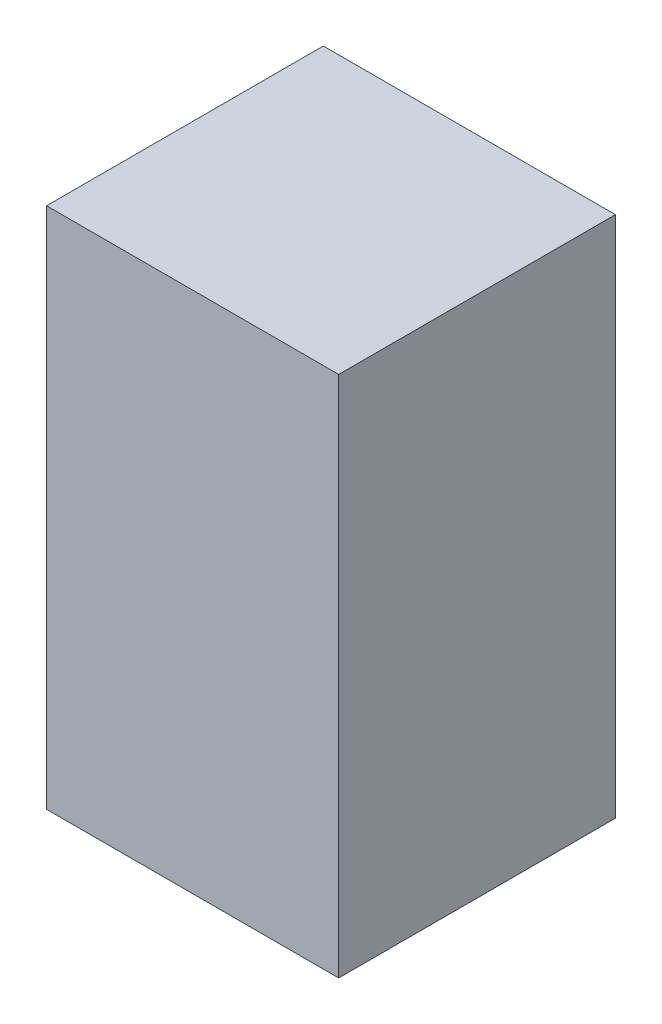
ISO-10303-21;
HEADER;
FILE_DESCRIPTION(('STEP AP214'),'2;1');
FILE_NAME('part.step','',(''),(''),'','','');
FILE_SCHEMA(('AUTOMOTIVE_DESIGN { 1 0 10303 214 1 1 1 1 }'));
ENDSEC;
DATA;
#1=APPLICATION_CONTEXT('core data for automotive mechanical design processes');
#2=APPLICATION_PROTOCOL_DEFINITION('international standard','automotive_design',2000,#1);
#3=PRODUCT_CONTEXT('',#1,'mechanical');
#4=PRODUCT('Part','Part','',(#3));
#5=PRODUCT_RELATED_PRODUCT_CATEGORY('part','',(#4));
#6=PRODUCT_DEFINITION_FORMATION('','',#4);
#7=PRODUCT_DEFINITION_CONTEXT('part definition',#1,'design');
#8=PRODUCT_DEFINITION('design','',#6,#7);
#9=PRODUCT_DEFINITION_SHAPE('','',#8);
#10=(LENGTH_UNIT() NAMED_UNIT(*) SI_UNIT(.MILLI.,.METRE.));
#11=(NAMED_UNIT(*) PLANE_ANGLE_UNIT() SI_UNIT($,.RADIAN.));
#12=(NAMED_UNIT(*) SI_UNIT($,.STERADIAN.) SOLID_ANGLE_UNIT());
#13=UNCERTAINTY_MEASURE_WITH_UNIT(LENGTH_MEASURE(1.E-05),#10,'distance_accuracy_value','');
#14=(GEOMETRIC_REPRESENTATION_CONTEXT(3) GLOBAL_UNCERTAINTY_ASSIGNED_CONTEXT((#13)) GLOBAL_UNIT_ASSIGNED_CONTEXT((#10,
#11,#12)) REPRESENTATION_CONTEXT('',''));
#15=CARTESIAN_POINT('',(0.,0.,0.));
#16=DIRECTION('',(0.,0.,1.));
#17=DIRECTION('',(1.,0.,0.));
#18=AXIS2_PLACEMENT_3D('',#15,#16,#17);
#19=CARTESIAN_POINT('',(0.47500032,-0.85000084,0.90000074));
#20=DIRECTION('',(0.,0.,-1.));
#21=DIRECTION('',(-1.,0.,0.));
#22=AXIS2_PLACEMENT_3D('',#19,#20,#21);
#23=PLANE('',#22);
#24=DIRECTION('',(1.,0.,0.));
#25=VECTOR('',#24,1.);
#26=CARTESIAN_POINT('',(0.47500032,0.85000084,0.90000074));
#27=LINE('',#26,#25);
#28=CARTESIAN_POINT('',(0.47500032,0.85000084,0.90000074));
#29=VERTEX_POINT('',#28);
#30=CARTESIAN_POINT('',(-0.47500032,0.85000084,0.90000074));
#31=VERTEX_POINT('',#30);
#32=EDGE_CURVE('E54',#29,#31,#27,.F.);
#33=ORIENTED_EDGE('',*,*,#32,.T.);
#34=DIRECTION('',(0.,1.,0.));
#35=VECTOR('',#34,1.);
#36=CARTESIAN_POINT('',(-0.47500032,0.85000084,0.90000074));
#37=LINE('',#36,#35);
#38=CARTESIAN_POINT('',(-0.47500032,-0.85000084,0.90000074));
#39=VERTEX_POINT('',#38);
#40=EDGE_CURVE('E56',#31,#39,#37,.F.);
#41=ORIENTED_EDGE('',*,*,#40,.T.);
#42=DIRECTION('',(1.,0.,0.));
#43=VECTOR('',#42,1.);
#44=CARTESIAN_POINT('',(-0.47500032,-0.85000084,0.90000074));
#45=LINE('',#44,#43);
#46=CARTESIAN_POINT('',(0.47500032,-0.85000084,0.90000074));
#47=VERTEX_POINT('',#46);
#48=EDGE_CURVE('E19',#39,#47,#45,.T.);
#49=ORIENTED_EDGE('',*,*,#48,.T.);
#50=DIRECTION('',(0.,1.,0.));
#51=VECTOR('',#50,1.);
#52=CARTESIAN_POINT('',(0.47500032,-0.85000084,0.90000074));
#53=LINE('',#52,#51);
#54=EDGE_CURVE('E79',#47,#29,#53,.T.);
#55=ORIENTED_EDGE('',*,*,#54,.T.);
#56=EDGE_LOOP('',(#33,#41,#49,#55));
#57=FACE_BOUND('',#56,.T.);
#58=ADVANCED_FACE('F16',(#57),#23,.F.);
#59=CARTESIAN_POINT('',(-0.47500032,-0.85000084,0.));
#60=DIRECTION('',(0.,1.,0.));
#61=DIRECTION('',(0.,0.,1.));
#62=AXIS2_PLACEMENT_3D('',#59,#60,#61);
#63=PLANE('',#62);
#64=DIRECTION('',(0.,0.,1.));
#65=VECTOR('',#64,1.);
#66=CARTESIAN_POINT('',(0.47500032,-0.85000084,0.));
#67=LINE('',#66,#65);
#68=CARTESIAN_POINT('',(0.47500032,-0.85000084,0.));
#69=VERTEX_POINT('',#68);
#70=EDGE_CURVE('E67',#69,#47,#67,.T.);
#71=ORIENTED_EDGE('',*,*,#70,.T.);
#72=ORIENTED_EDGE('',*,*,#48,.F.);
#73=DIRECTION('',(0.,0.,-1.));
#74=VECTOR('',#73,1.);
#75=CARTESIAN_POINT('',(-0.47500032,-0.85000084,0.));
#76=LINE('',#75,#74);
#77=CARTESIAN_POINT('',(-0.47500032,-0.85000084,0.));
#78=VERTEX_POINT('',#77);
#79=EDGE_CURVE('E62',#39,#78,#76,.T.);
#80=ORIENTED_EDGE('',*,*,#79,.T.);
#81=DIRECTION('',(-1.,0.,0.));
#82=VECTOR('',#81,1.);
#83=CARTESIAN_POINT('',(0.47500032,-0.85000084,0.));
#84=LINE('',#83,#82);
#85=EDGE_CURVE('E82',#69,#78,#84,.T.);
#86=ORIENTED_EDGE('',*,*,#85,.F.);
#87=EDGE_LOOP('',(#71,#72,#80,#86));
#88=FACE_BOUND('',#87,.T.);
#89=ADVANCED_FACE('F64',(#88),#63,.F.);
#90=CARTESIAN_POINT('',(-0.47500032,0.85000084,0.));
#91=DIRECTION('',(1.,0.,0.));
#92=DIRECTION('',(0.,0.,-1.));
#93=AXIS2_PLACEMENT_3D('',#90,#91,#92);
#94=PLANE('',#93);
#95=ORIENTED_EDGE('',*,*,#79,.F.);
#96=ORIENTED_EDGE('',*,*,#40,.F.);
#97=DIRECTION('',(0.,0.,-1.));
#98=VECTOR('',#97,1.);
#99=CARTESIAN_POINT('',(-0.47500032,0.85000084,0.));
#100=LINE('',#99,#98);
#101=CARTESIAN_POINT('',(-0.47500032,0.85000084,0.));
#102=VERTEX_POINT('',#101);
#103=EDGE_CURVE('E74',#31,#102,#100,.T.);
#104=ORIENTED_EDGE('',*,*,#103,.T.);
#105=DIRECTION('',(0.,1.,0.));
#106=VECTOR('',#105,1.);
#107=CARTESIAN_POINT('',(-0.47500032,-0.85000084,0.));
#108=LINE('',#107,#106);
#109=EDGE_CURVE('E71',#78,#102,#108,.T.);
#110=ORIENTED_EDGE('',*,*,#109,.F.);
#111=EDGE_LOOP('',(#95,#96,#104,#110));
#112=FACE_BOUND('',#111,.T.);
#113=ADVANCED_FACE('F69',(#112),#94,.F.);
#114=CARTESIAN_POINT('',(0.47500032,0.85000084,0.));
#115=DIRECTION('',(0.,-1.,0.));
#116=DIRECTION('',(0.,0.,-1.));
#117=AXIS2_PLACEMENT_3D('',#114,#115,#116);
#118=PLANE('',#117);
#119=ORIENTED_EDGE('',*,*,#103,.F.);
#120=ORIENTED_EDGE('',*,*,#32,.F.);
#121=DIRECTION('',(0.,0.,1.));
#122=VECTOR('',#121,1.);
#123=CARTESIAN_POINT('',(0.47500032,0.85000084,0.));
#124=LINE('',#123,#122);
#125=CARTESIAN_POINT('',(0.47500032,0.85000084,0.));
#126=VERTEX_POINT('',#125);
#127=EDGE_CURVE('E34',#29,#126,#124,.F.);
#128=ORIENTED_EDGE('',*,*,#127,.T.);
#129=DIRECTION('',(-1.,0.,0.));
#130=VECTOR('',#129,1.);
#131=CARTESIAN_POINT('',(0.47500032,0.85000084,0.));
#132=LINE('',#131,#130);
#133=EDGE_CURVE('E25',#102,#126,#132,.F.);
#134=ORIENTED_EDGE('',*,*,#133,.F.);
#135=EDGE_LOOP('',(#119,#120,#128,#134));
#136=FACE_BOUND('',#135,.T.);
#137=ADVANCED_FACE('F88',(#136),#118,.F.);
#138=CARTESIAN_POINT('',(0.47500032,-0.85000084,0.));
#139=DIRECTION('',(-1.,0.,0.));
#140=DIRECTION('',(0.,0.,1.));
#141=AXIS2_PLACEMENT_3D('',#138,#139,#140);
#142=PLANE('',#141);
#143=ORIENTED_EDGE('',*,*,#127,.F.);
#144=ORIENTED_EDGE('',*,*,#54,.F.);
#145=ORIENTED_EDGE('',*,*,#70,.F.);
#146=DIRECTION('',(0.,1.,0.));
#147=VECTOR('',#146,1.);
#148=CARTESIAN_POINT('',(0.47500032,-0.85000084,0.));
#149=LINE('',#148,#147);
#150=EDGE_CURVE('E11',#126,#69,#149,.F.);
#151=ORIENTED_EDGE('',*,*,#150,.F.);
#152=EDGE_LOOP('',(#143,#144,#145,#151));
#153=FACE_BOUND('',#152,.T.);
#154=ADVANCED_FACE('F90',(#153),#142,.F.);
#155=CARTESIAN_POINT('',(0.47500032,-0.85000084,0.));
#156=DIRECTION('',(0.,0.,-1.));
#157=DIRECTION('',(-1.,0.,0.));
#158=AXIS2_PLACEMENT_3D('',#155,#156,#157);
#159=PLANE('',#158);
#160=ORIENTED_EDGE('',*,*,#133,.T.);
#161=ORIENTED_EDGE('',*,*,#150,.T.);
#162=ORIENTED_EDGE('',*,*,#85,.T.);
#163=ORIENTED_EDGE('',*,*,#109,.T.);
#164=EDGE_LOOP('',(#160,#161,#162,#163));
#165=FACE_BOUND('',#164,.T.);
#166=ADVANCED_FACE('F87',(#165),#159,.T.);
#167=CLOSED_SHELL('',(#58,#89,#113,#137,#154,#166));
#168=MANIFOLD_SOLID_BREP('B1',#167);
#169=ADVANCED_BREP_SHAPE_REPRESENTATION('',(#18,#168),#14);
#170=SHAPE_DEFINITION_REPRESENTATION(#9,#169);
ENDSEC;
END-ISO-10303-21;
